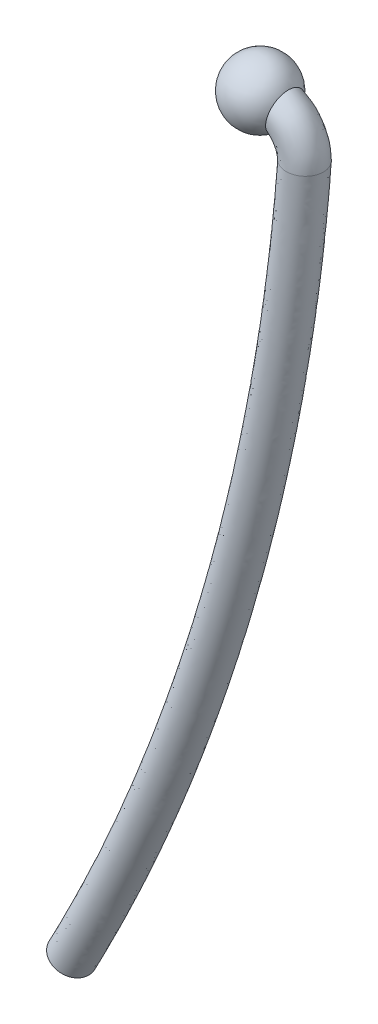
ISO-10303-21;
HEADER;
FILE_DESCRIPTION(('STEP AP214'),'2;1');
FILE_NAME('part.step','',(''),(''),'','','');
FILE_SCHEMA(('AUTOMOTIVE_DESIGN { 1 0 10303 214 1 1 1 1 }'));
ENDSEC;
DATA;
#1=APPLICATION_CONTEXT('core data for automotive mechanical design processes');
#2=APPLICATION_PROTOCOL_DEFINITION('international standard','automotive_design',2000,#1);
#3=PRODUCT_CONTEXT('',#1,'mechanical');
#4=PRODUCT('Part','Part','',(#3));
#5=PRODUCT_RELATED_PRODUCT_CATEGORY('part','',(#4));
#6=PRODUCT_DEFINITION_FORMATION('','',#4);
#7=PRODUCT_DEFINITION_CONTEXT('part definition',#1,'design');
#8=PRODUCT_DEFINITION('design','',#6,#7);
#9=PRODUCT_DEFINITION_SHAPE('','',#8);
#10=(LENGTH_UNIT() NAMED_UNIT(*) SI_UNIT(.MILLI.,.METRE.));
#11=(NAMED_UNIT(*) PLANE_ANGLE_UNIT() SI_UNIT($,.RADIAN.));
#12=(NAMED_UNIT(*) SI_UNIT($,.STERADIAN.) SOLID_ANGLE_UNIT());
#13=UNCERTAINTY_MEASURE_WITH_UNIT(LENGTH_MEASURE(1.E-05),#10,'distance_accuracy_value','');
#14=(GEOMETRIC_REPRESENTATION_CONTEXT(3) GLOBAL_UNCERTAINTY_ASSIGNED_CONTEXT((#13)) GLOBAL_UNIT_ASSIGNED_CONTEXT((#10,
#11,#12)) REPRESENTATION_CONTEXT('',''));
#15=CARTESIAN_POINT('',(0.,0.,0.));
#16=DIRECTION('',(0.,0.,1.));
#17=DIRECTION('',(1.,0.,0.));
#18=AXIS2_PLACEMENT_3D('',#15,#16,#17);
#19=CARTESIAN_POINT('',(0.,0.,0.));
#20=DIRECTION('',(0.,1.,0.));
#21=DIRECTION('',(0.,0.,1.));
#22=AXIS2_PLACEMENT_3D('',#19,#20,#21);
#23=SPHERICAL_SURFACE('',#22,0.25);
#24=CARTESIAN_POINT('',(0.196209649531552,-0.0387527215909466,-0.15));
#25=CARTESIAN_POINT('',(0.192610158822883,-0.0569716840393427,-0.149987281267136));
#26=CARTESIAN_POINT('',(0.188767840688836,-0.0752104187428228,-0.146810368722109));
#27=CARTESIAN_POINT('',(0.180948086791766,-0.109551183023133,-0.134567139338089));
#28=CARTESIAN_POINT('',(0.176970357554993,-0.12564814436129,-0.12548714202756));
#29=CARTESIAN_POINT('',(0.169466921402626,-0.153873282757319,-0.10221658797435));
#30=CARTESIAN_POINT('',(0.165940944050965,-0.166003841071902,-0.0880291083327406));
#31=CARTESIAN_POINT('',(0.161789696204247,-0.179561611129173,-0.0645116221969879));
#32=CARTESIAN_POINT('',(0.160612525721884,-0.183266814430272,-0.0565308536486733));
#33=CARTESIAN_POINT('',(0.158695687400933,-0.189191565149892,-0.0399938863186769));
#34=CARTESIAN_POINT('',(0.157954933015369,-0.191414804052597,-0.0314391762029283));
#35=CARTESIAN_POINT('',(0.157050676214533,-0.194112957172962,-0.0148256037830967));
#36=CARTESIAN_POINT('',(0.15684102446295,-0.19472780995727,-0.00679187311560768));
#37=CARTESIAN_POINT('',(0.156887524051654,-0.19458996667973,0.0092552351301373));
#38=CARTESIAN_POINT('',(0.157143539976832,-0.19383766818244,0.0172686179469376));
#39=CARTESIAN_POINT('',(0.158516191110306,-0.189735796527903,0.0399924693192685));
#40=CARTESIAN_POINT('',(0.160191980811877,-0.184682989674599,0.0543895763902141));
#41=CARTESIAN_POINT('',(0.164652199828413,-0.170281138983522,0.0815424213039328));
#42=CARTESIAN_POINT('',(0.167489467201309,-0.160723482904299,0.0941748164948794));
#43=CARTESIAN_POINT('',(0.173921816268022,-0.137385068186273,0.116944898987194));
#44=CARTESIAN_POINT('',(0.177561866168537,-0.123304192263076,0.126760557488894));
#45=CARTESIAN_POINT('',(0.18508044690239,-0.0918267465402,0.141959413615639));
#46=CARTESIAN_POINT('',(0.188959649946175,-0.0742778495773898,0.147026876983786));
#47=CARTESIAN_POINT('',(0.196425030741157,-0.038092054159478,0.151053213007837));
#48=CARTESIAN_POINT('',(0.200004983425206,-0.0194415914299598,0.149904968026665));
#49=CARTESIAN_POINT('',(0.20644845709116,0.0161132233899729,0.141273055169428));
#50=CARTESIAN_POINT('',(0.209323857217965,0.0330432240716428,0.133905354339318));
#51=CARTESIAN_POINT('',(0.214169488130775,0.0629542341727532,0.113961896392814));
#52=CARTESIAN_POINT('',(0.21616368191071,0.0760360536107423,0.101544372103161));
#53=CARTESIAN_POINT('',(0.219223130611246,0.096731833666152,0.0733555857900673));
#54=CARTESIAN_POINT('',(0.220318829218613,0.104523298956373,0.0577189205965566));
#55=CARTESIAN_POINT('',(0.221649477226201,0.114059152333074,0.025263630090405));
#56=CARTESIAN_POINT('',(0.221913613357304,0.116008469568781,0.00850670264185721));
#57=CARTESIAN_POINT('',(0.221662867168512,0.114185619099368,-0.0243400339542283));
#58=CARTESIAN_POINT('',(0.221163644380876,0.110528458665149,-0.0404364809675989));
#59=CARTESIAN_POINT('',(0.219419933843638,0.0981918990676106,-0.0705676861369477));
#60=CARTESIAN_POINT('',(0.21817316343593,0.08949712014299,-0.0845959649478891));
#61=CARTESIAN_POINT('',(0.214924297977232,0.0679294102042349,-0.109423806892059));
#62=CARTESIAN_POINT('',(0.212904506763113,0.0549596627553694,-0.120136189479965));
#63=CARTESIAN_POINT('',(0.208108754953098,0.0258695190527544,-0.137186007207907));
#64=CARTESIAN_POINT('',(0.205308457171723,0.00965347939882407,-0.143354307700277));
#65=CARTESIAN_POINT('',(0.200332578011847,-0.0174716018150883,-0.148934870098712));
#66=CARTESIAN_POINT('',(0.198312554255703,-0.0281087874061511,-0.150007430574375));
#67=CARTESIAN_POINT('',(0.196209649531552,-0.0387527215909466,-0.15));
#68=B_SPLINE_CURVE_WITH_KNOTS('',3,(#24,#25,#26,#27,#28,#29,#30,#31,#32,#33,#34,#35,#36,#37,#38,
#39,#40,#41,#42,#43,#44,#45,#46,#47,#48,#49,#50,#51,#52,#53,#54,#55,#56,#57,#58,#59,#60,#61,#62,
#63,#64,#65,#66,#67),.UNSPECIFIED.,.T.,.F.,(4,2,2,2,2,2,2,2,2,2,2,2,2,2,2,2,2,2,2,2,2,4),(0.,
0.0555801830550502,0.111289635257173,0.166965580242578,0.19347282297353,0.219913788527817,
0.243963338324473,0.268005895684496,0.313209906225085,0.36075099269438,0.412522620387508,
0.467533295449345,0.523494975653345,0.578435678636951,0.631773325429137,0.683218871696011,
0.732837379055482,0.781451581723809,0.83021499068101,0.880168825000054,0.931899169011179,
0.964370382017544),.UNSPECIFIED.);
#69=CARTESIAN_POINT('',(0.196209649531552,-0.0387527215909466,-0.15));
#70=VERTEX_POINT('',#69);
#71=EDGE_CURVE('E11',#70,#70,#68,.T.);
#72=ORIENTED_EDGE('',*,*,#71,.T.);
#73=EDGE_LOOP('',(#72));
#74=FACE_BOUND('',#73,.T.);
#75=ADVANCED_FACE('F45',(#74),#23,.T.);
#76=CARTESIAN_POINT('',(0.05,0.,-0.15));
#77=CARTESIAN_POINT('',(0.070612126372054,0.,-0.15));
#78=CARTESIAN_POINT('',(0.111678763808335,-0.00475035948913755,-0.15));
#79=CARTESIAN_POINT('',(0.175583795185796,-0.025625995231415,-0.15));
#80=CARTESIAN_POINT('',(0.23587135332701,-0.061366755382337,-0.15));
#81=CARTESIAN_POINT('',(0.279562358160648,-0.103566966063429,-0.15));
#82=CARTESIAN_POINT('',(0.312746104509767,-0.153268833164525,-0.15));
#83=CARTESIAN_POINT('',(0.334121347331334,-0.201599537443067,-0.15));
#84=CARTESIAN_POINT('',(0.347195475968437,-0.252428746997234,-0.15));
#85=CARTESIAN_POINT('',(0.35,-0.283923021029257,-0.15));
#86=CARTESIAN_POINT('',(0.35,-0.3,-0.15));
#87=CARTESIAN_POINT('',(0.05,0.3,-0.15));
#88=CARTESIAN_POINT('',(0.0706121263720541,0.3,-0.15));
#89=CARTESIAN_POINT('',(0.190291027722327,0.289800577812004,-0.15));
#90=CARTESIAN_POINT('',(0.299307207087605,0.24874847259628,-0.15));
#91=CARTESIAN_POINT('',(0.423066964535489,0.177705420472651,-0.15));
#92=CARTESIAN_POINT('',(0.514818972912154,0.0861613070571044,-0.15));
#93=CARTESIAN_POINT('',(0.580923737307374,-0.0144263030527691,-0.15));
#94=CARTESIAN_POINT('',(0.621398278715104,-0.112817436820869,-0.15));
#95=CARTESIAN_POINT('',(0.646160259721789,-0.201732882702754,-0.15));
#96=CARTESIAN_POINT('',(0.65,-0.295398956019108,-0.15));
#97=CARTESIAN_POINT('',(0.65,-0.311475934989851,-0.15));
#98=CARTESIAN_POINT('',(0.05,0.3,0.15));
#99=CARTESIAN_POINT('',(0.0706121263720541,0.3,0.15));
#100=CARTESIAN_POINT('',(0.190291027722327,0.289800577812004,0.15));
#101=CARTESIAN_POINT('',(0.299307207087605,0.24874847259628,0.15));
#102=CARTESIAN_POINT('',(0.423066964535489,0.177705420472651,0.15));
#103=CARTESIAN_POINT('',(0.514818972912154,0.0861613070571044,0.15));
#104=CARTESIAN_POINT('',(0.580923737307374,-0.0144263030527691,0.15));
#105=CARTESIAN_POINT('',(0.621398278715104,-0.112817436820869,0.15));
#106=CARTESIAN_POINT('',(0.646160259721789,-0.201732882702754,0.15));
#107=CARTESIAN_POINT('',(0.65,-0.295398956019108,0.15));
#108=CARTESIAN_POINT('',(0.65,-0.311475934989851,0.15));
#109=CARTESIAN_POINT('',(0.05,0.,0.15));
#110=CARTESIAN_POINT('',(0.0706121263720541,0.,0.15));
#111=CARTESIAN_POINT('',(0.111678763808335,-0.00475035948913753,0.15));
#112=CARTESIAN_POINT('',(0.175583795185796,-0.0256259952314149,0.15));
#113=CARTESIAN_POINT('',(0.23587135332701,-0.0613667553823371,0.15));
#114=CARTESIAN_POINT('',(0.279562358160649,-0.103566966063429,0.15));
#115=CARTESIAN_POINT('',(0.312746104509767,-0.153268833164525,0.15));
#116=CARTESIAN_POINT('',(0.334121347331334,-0.201599537443067,0.15));
#117=CARTESIAN_POINT('',(0.347195475968437,-0.252428746997234,0.15));
#118=CARTESIAN_POINT('',(0.35,-0.283923021029257,0.15));
#119=CARTESIAN_POINT('',(0.35,-0.3,0.15));
#120=CARTESIAN_POINT('',(0.05,-0.3,0.15));
#121=CARTESIAN_POINT('',(0.070612126372054,-0.3,0.15));
#122=CARTESIAN_POINT('',(0.0330664998943435,-0.299301296790279,0.15));
#123=CARTESIAN_POINT('',(0.0518603832839872,-0.30000046305911,0.15));
#124=CARTESIAN_POINT('',(0.0486757421185307,-0.300438931237325,0.15));
#125=CARTESIAN_POINT('',(0.0443057434091437,-0.293295239183962,0.15));
#126=CARTESIAN_POINT('',(0.0445684717121609,-0.292111363276281,0.15));
#127=CARTESIAN_POINT('',(0.046844415947564,-0.290381638065265,0.15));
#128=CARTESIAN_POINT('',(0.0482306922150845,-0.303124611291713,0.15));
#129=CARTESIAN_POINT('',(0.0500000000000001,-0.272447086039406,0.15));
#130=CARTESIAN_POINT('',(0.0500000000000001,-0.288524065010149,0.15));
#131=CARTESIAN_POINT('',(0.05,-0.3,-0.15));
#132=CARTESIAN_POINT('',(0.070612126372054,-0.3,-0.15));
#133=CARTESIAN_POINT('',(0.0330664998943435,-0.299301296790279,-0.15));
#134=CARTESIAN_POINT('',(0.0518603832839872,-0.30000046305911,-0.15));
#135=CARTESIAN_POINT('',(0.0486757421185307,-0.300438931237325,-0.15));
#136=CARTESIAN_POINT('',(0.0443057434091437,-0.293295239183962,-0.15));
#137=CARTESIAN_POINT('',(0.0445684717121609,-0.292111363276281,-0.15));
#138=CARTESIAN_POINT('',(0.046844415947564,-0.290381638065265,-0.15));
#139=CARTESIAN_POINT('',(0.0482306922150845,-0.303124611291713,-0.15));
#140=CARTESIAN_POINT('',(0.0500000000000001,-0.272447086039406,-0.15));
#141=CARTESIAN_POINT('',(0.0500000000000001,-0.288524065010149,-0.15));
#142=CARTESIAN_POINT('',(0.05,0.,-0.15));
#143=CARTESIAN_POINT('',(0.070612126372054,0.,-0.15));
#144=CARTESIAN_POINT('',(0.111678763808335,-0.00475035948913755,-0.15));
#145=CARTESIAN_POINT('',(0.175583795185796,-0.025625995231415,-0.15));
#146=CARTESIAN_POINT('',(0.23587135332701,-0.061366755382337,-0.15));
#147=CARTESIAN_POINT('',(0.279562358160648,-0.103566966063429,-0.15));
#148=CARTESIAN_POINT('',(0.312746104509767,-0.153268833164525,-0.15));
#149=CARTESIAN_POINT('',(0.334121347331334,-0.201599537443067,-0.15));
#150=CARTESIAN_POINT('',(0.347195475968437,-0.252428746997234,-0.15));
#151=CARTESIAN_POINT('',(0.35,-0.283923021029257,-0.15));
#152=CARTESIAN_POINT('',(0.35,-0.3,-0.15));
#153=(BOUNDED_SURFACE() B_SPLINE_SURFACE(3,3,((#76,#77,#78,#79,#80,#81,#82,#83,#84,#85,#86),
(#87,#88,#89,#90,#91,#92,#93,#94,#95,#96,#97),(#98,#99,#100,#101,#102,#103,#104,#105,#106,#107,
#108),(#109,#110,#111,#112,#113,#114,#115,#116,#117,#118,#119),(#120,#121,#122,#123,#124,#125,
#126,#127,#128,#129,#130),(#131,#132,#133,#134,#135,#136,#137,#138,#139,#140,#141),(#142,#143,
#144,#145,#146,#147,#148,#149,#150,#151,#152)),.UNSPECIFIED.,.T.,.F.,
.F.) B_SPLINE_SURFACE_WITH_KNOTS((4,3,4),(4,1,1,1,1,1,1,1,4),(0.,0.5,1.),(0.,0.133901089613182,
0.270695779625652,0.412547291728431,0.56377637646843,0.677576561676362,0.787367057121807,
0.89379756555187,1.),
.UNSPECIFIED.) GEOMETRIC_REPRESENTATION_ITEM() RATIONAL_B_SPLINE_SURFACE(((1.,1.,1.,1.,1.,1.,1.,
1.,1.,1.,1.),(0.333333333333333,0.333333333333333,0.333333333333334,0.333333333333333,
0.333333333333334,0.333333333333333,0.333333333333333,0.333333333333333,0.333333333333333,
0.333333333333333,0.333333333333333),(0.333333333333333,0.333333333333333,0.333333333333334,
0.333333333333333,0.333333333333334,0.333333333333333,0.333333333333333,0.333333333333333,
0.333333333333333,0.333333333333333,0.333333333333333),(1.,1.,1.,1.,1.,1.,1.,1.,1.,1.,1.),
(0.333333333333333,0.333333333333333,0.333333333333334,0.333333333333333,0.333333333333334,
0.333333333333333,0.333333333333333,0.333333333333333,0.333333333333333,0.333333333333333,
0.333333333333333),(0.333333333333333,0.333333333333333,0.333333333333334,0.333333333333333,
0.333333333333334,0.333333333333333,0.333333333333333,0.333333333333333,0.333333333333333,
0.333333333333333,0.333333333333333),(1.,1.,1.,1.,1.,1.,1.,1.,1.,1.,1.))) REPRESENTATION_ITEM('') SURFACE());
#154=CARTESIAN_POINT('',(0.35,-0.3,-0.15));
#155=CARTESIAN_POINT('',(0.0500000000000001,-0.288524065010149,-0.15));
#156=CARTESIAN_POINT('',(0.0500000000000001,-0.288524065010149,0.15));
#157=CARTESIAN_POINT('',(0.35,-0.3,0.15));
#158=CARTESIAN_POINT('',(0.65,-0.311475934989851,0.15));
#159=CARTESIAN_POINT('',(0.65,-0.311475934989851,-0.15));
#160=CARTESIAN_POINT('',(0.35,-0.3,-0.15));
#161=(BOUNDED_CURVE() B_SPLINE_CURVE(3,(#154,#155,#156,#157,#158,#159,#160),.UNSPECIFIED.,.T.,
.F.) B_SPLINE_CURVE_WITH_KNOTS((4,3,4),(0.,0.5,1.),
.UNSPECIFIED.) CURVE() GEOMETRIC_REPRESENTATION_ITEM() RATIONAL_B_SPLINE_CURVE((1.,
0.333333333333333,0.333333333333333,1.,0.333333333333333,0.333333333333333,1.)) REPRESENTATION_ITEM(''));
#162=CARTESIAN_POINT('',(0.35,-0.3,-0.15));
#163=VERTEX_POINT('',#162);
#164=EDGE_CURVE('E60',#163,#163,#161,.T.);
#165=ORIENTED_EDGE('',*,*,#71,.F.);
#166=EDGE_LOOP('',(#165));
#167=FACE_BOUND('',#166,.T.);
#168=ORIENTED_EDGE('',*,*,#164,.T.);
#169=EDGE_LOOP('',(#168));
#170=FACE_BOUND('',#169,.T.);
#171=ADVANCED_FACE('F47',(#167,#170),#153,.T.);
#172=CARTESIAN_POINT('',(-1.48489910288595,-6.65009658728105,0.15));
#173=DIRECTION('',(-0.467198468352628,-0.884152470543943,0.));
#174=DIRECTION('',(0.884152470543943,-0.467198468352628,0.));
#175=AXIS2_PLACEMENT_3D('',#172,#173,#174);
#176=PLANE('',#175);
#177=CARTESIAN_POINT('',(-1.48489910288595,-6.65009658728105,0.));
#178=DIRECTION('',(-0.467198468352629,-0.884152470543943,0.));
#179=DIRECTION('',(0.884152470543943,-0.467198468352629,0.));
#180=AXIS2_PLACEMENT_3D('',#177,#178,#179);
#181=CIRCLE('',#180,0.15);
#182=CARTESIAN_POINT('',(-1.35227623230436,-6.72017635753395,0.));
#183=VERTEX_POINT('',#182);
#184=EDGE_CURVE('E52',#183,#183,#181,.T.);
#185=ORIENTED_EDGE('',*,*,#184,.T.);
#186=EDGE_LOOP('',(#185));
#187=FACE_BOUND('',#186,.T.);
#188=ADVANCED_FACE('F73',(#187),#176,.T.);
#189=CARTESIAN_POINT('',(0.35,-0.3,-0.15));
#190=CARTESIAN_POINT('',(0.302676632596426,-0.917650576415767,-0.15));
#191=CARTESIAN_POINT('',(0.134000791326066,-2.15157946941135,-0.15));
#192=CARTESIAN_POINT('',(-0.29397800302794,-3.83267812159043,-0.15));
#193=CARTESIAN_POINT('',(-0.842015894366938,-5.33586841241956,-0.15));
#194=CARTESIAN_POINT('',(-1.25764607891864,-6.22003027459009,-0.15));
#195=CARTESIAN_POINT('',(-1.48489910288595,-6.65009658728105,-0.15));
#196=CARTESIAN_POINT('',(0.0500000000000001,-0.288524065010149,-0.15));
#197=CARTESIAN_POINT('',(0.00267663259642644,-0.906174641425917,-0.15));
#198=CARTESIAN_POINT('',(-0.162775839502434,-2.09661855976979,-0.15));
#199=CARTESIAN_POINT('',(-0.582472344994634,-3.75030085167651,-0.15));
#200=CARTESIAN_POINT('',(-1.12278916715667,-5.22702605693542,-0.15));
#201=CARTESIAN_POINT('',(-1.52289182008182,-6.0798707340843,-0.15));
#202=CARTESIAN_POINT('',(-1.75014484404913,-6.50993704677526,-0.15));
#203=CARTESIAN_POINT('',(0.0500000000000001,-0.288524065010149,0.15));
#204=CARTESIAN_POINT('',(0.00267663259642644,-0.906174641425917,0.15));
#205=CARTESIAN_POINT('',(-0.162775839502434,-2.09661855976979,0.15));
#206=CARTESIAN_POINT('',(-0.582472344994634,-3.75030085167651,0.15));
#207=CARTESIAN_POINT('',(-1.12278916715667,-5.22702605693542,0.15));
#208=CARTESIAN_POINT('',(-1.52289182008182,-6.0798707340843,0.15));
#209=CARTESIAN_POINT('',(-1.75014484404913,-6.50993704677526,0.15));
#210=CARTESIAN_POINT('',(0.35,-0.3,0.15));
#211=CARTESIAN_POINT('',(0.302676632596426,-0.917650576415767,0.15));
#212=CARTESIAN_POINT('',(0.134000791326066,-2.15157946941135,0.15));
#213=CARTESIAN_POINT('',(-0.29397800302794,-3.83267812159043,0.15));
#214=CARTESIAN_POINT('',(-0.842015894366938,-5.33586841241956,0.15));
#215=CARTESIAN_POINT('',(-1.25764607891864,-6.22003027459009,0.15));
#216=CARTESIAN_POINT('',(-1.48489910288595,-6.65009658728105,0.15));
#217=CARTESIAN_POINT('',(0.65,-0.311475934989851,0.15));
#218=CARTESIAN_POINT('',(0.602676632596426,-0.929126511405618,0.15));
#219=CARTESIAN_POINT('',(0.430777422154565,-2.20654037905291,0.15));
#220=CARTESIAN_POINT('',(-0.0054836610612456,-3.91505539150435,0.15));
#221=CARTESIAN_POINT('',(-0.561242621577204,-5.4447107679037,0.15));
#222=CARTESIAN_POINT('',(-0.992400337755455,-6.36018981509587,0.15));
#223=CARTESIAN_POINT('',(-1.21965336172277,-6.79025612778684,0.15));
#224=CARTESIAN_POINT('',(0.65,-0.311475934989851,-0.15));
#225=CARTESIAN_POINT('',(0.602676632596426,-0.929126511405618,-0.15));
#226=CARTESIAN_POINT('',(0.430777422154565,-2.20654037905291,-0.15));
#227=CARTESIAN_POINT('',(-0.0054836610612456,-3.91505539150435,-0.15));
#228=CARTESIAN_POINT('',(-0.561242621577204,-5.4447107679037,-0.15));
#229=CARTESIAN_POINT('',(-0.992400337755455,-6.36018981509587,-0.15));
#230=CARTESIAN_POINT('',(-1.21965336172277,-6.79025612778684,-0.15));
#231=CARTESIAN_POINT('',(0.35,-0.3,-0.15));
#232=CARTESIAN_POINT('',(0.302676632596426,-0.917650576415767,-0.15));
#233=CARTESIAN_POINT('',(0.134000791326066,-2.15157946941135,-0.15));
#234=CARTESIAN_POINT('',(-0.29397800302794,-3.83267812159043,-0.15));
#235=CARTESIAN_POINT('',(-0.842015894366938,-5.33586841241956,-0.15));
#236=CARTESIAN_POINT('',(-1.25764607891864,-6.22003027459009,-0.15));
#237=CARTESIAN_POINT('',(-1.48489910288595,-6.65009658728105,-0.15));
#238=(BOUNDED_SURFACE() B_SPLINE_SURFACE(3,3,((#189,#190,#191,#192,#193,#194,#195),(#196,#197,
#198,#199,#200,#201,#202),(#203,#204,#205,#206,#207,#208,#209),(#210,#211,#212,#213,#214,#215,
#216),(#217,#218,#219,#220,#221,#222,#223),(#224,#225,#226,#227,#228,#229,#230),(#231,#232,#233,
#234,#235,#236,#237)),.UNSPECIFIED.,.T.,.F.,.F.) B_SPLINE_SURFACE_WITH_KNOTS((4,3,4),(4,1,1,1,
4),(0.,0.5,1.),(0.,0.279349729031747,0.56015724803879,0.780647490815451,1.),
.UNSPECIFIED.) GEOMETRIC_REPRESENTATION_ITEM() RATIONAL_B_SPLINE_SURFACE(((1.,1.,1.,1.,1.,1.,
1.),(0.333333333333333,0.333333333333333,0.333333333333333,0.333333333333333,0.333333333333333,
0.333333333333333,0.333333333333333),(0.333333333333333,0.333333333333333,0.333333333333333,
0.333333333333333,0.333333333333333,0.333333333333333,0.333333333333333),(1.,1.,1.,1.,1.,1.,1.),
(0.333333333333333,0.333333333333333,0.333333333333333,0.333333333333333,0.333333333333333,
0.333333333333333,0.333333333333333),(0.333333333333333,0.333333333333333,0.333333333333333,
0.333333333333333,0.333333333333333,0.333333333333333,0.333333333333333),(1.,1.,1.,1.,1.,1.,1.))) REPRESENTATION_ITEM('') SURFACE());
#239=ORIENTED_EDGE('',*,*,#164,.F.);
#240=EDGE_LOOP('',(#239));
#241=FACE_BOUND('',#240,.T.);
#242=ORIENTED_EDGE('',*,*,#184,.F.);
#243=EDGE_LOOP('',(#242));
#244=FACE_BOUND('',#243,.T.);
#245=ADVANCED_FACE('F69',(#241,#244),#238,.F.);
#246=CLOSED_SHELL('',(#75,#171,#188,#245));
#247=MANIFOLD_SOLID_BREP('B2',#246);
#248=ADVANCED_BREP_SHAPE_REPRESENTATION('',(#18,#247),#14);
#249=SHAPE_DEFINITION_REPRESENTATION(#9,#248);
ENDSEC;
END-ISO-10303-21;
